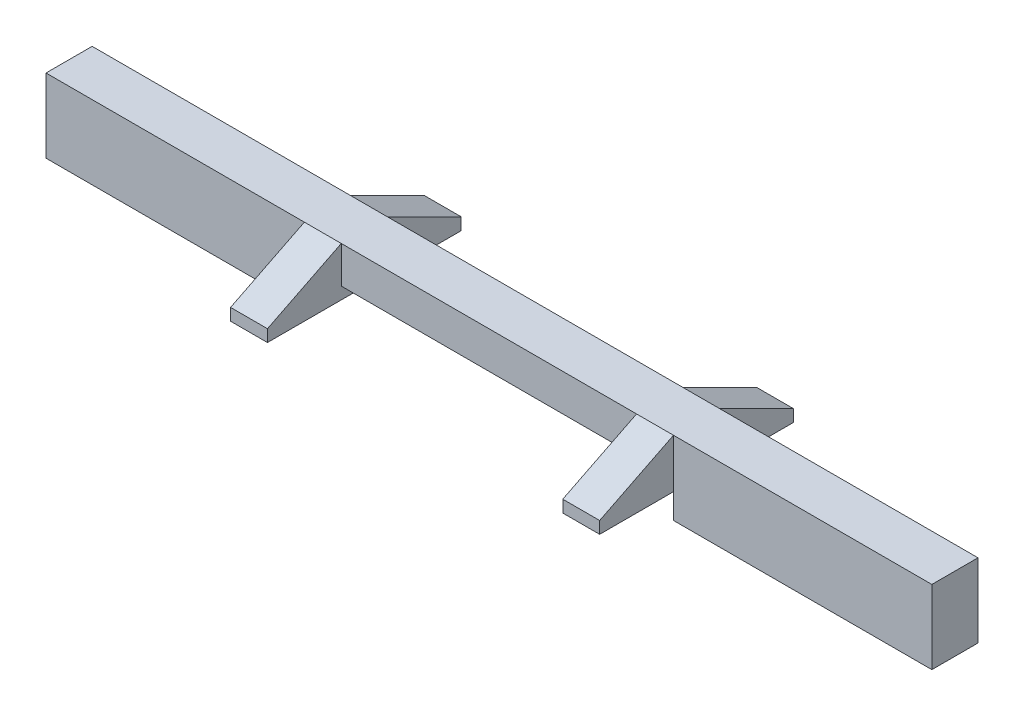
ISO-10303-21;
HEADER;
FILE_DESCRIPTION(('STEP AP214'),'2;1');
FILE_NAME('part.step','',(''),(''),'','','');
FILE_SCHEMA(('AUTOMOTIVE_DESIGN { 1 0 10303 214 1 1 1 1 }'));
ENDSEC;
DATA;
#1=APPLICATION_CONTEXT('core data for automotive mechanical design processes');
#2=APPLICATION_PROTOCOL_DEFINITION('international standard','automotive_design',2000,#1);
#3=PRODUCT_CONTEXT('',#1,'mechanical');
#4=PRODUCT('Part','Part','',(#3));
#5=PRODUCT_RELATED_PRODUCT_CATEGORY('part','',(#4));
#6=PRODUCT_DEFINITION_FORMATION('','',#4);
#7=PRODUCT_DEFINITION_CONTEXT('part definition',#1,'design');
#8=PRODUCT_DEFINITION('design','',#6,#7);
#9=PRODUCT_DEFINITION_SHAPE('','',#8);
#10=(LENGTH_UNIT() NAMED_UNIT(*) SI_UNIT(.MILLI.,.METRE.));
#11=(NAMED_UNIT(*) PLANE_ANGLE_UNIT() SI_UNIT($,.RADIAN.));
#12=(NAMED_UNIT(*) SI_UNIT($,.STERADIAN.) SOLID_ANGLE_UNIT());
#13=UNCERTAINTY_MEASURE_WITH_UNIT(LENGTH_MEASURE(1.E-05),#10,'distance_accuracy_value','');
#14=(GEOMETRIC_REPRESENTATION_CONTEXT(3) GLOBAL_UNCERTAINTY_ASSIGNED_CONTEXT((#13)) GLOBAL_UNIT_ASSIGNED_CONTEXT((#10,
#11,#12)) REPRESENTATION_CONTEXT('',''));
#15=CARTESIAN_POINT('',(0.,0.,0.));
#16=DIRECTION('',(0.,0.,1.));
#17=DIRECTION('',(1.,0.,0.));
#18=AXIS2_PLACEMENT_3D('',#15,#16,#17);
#19=CARTESIAN_POINT('',(0.,0.,1.25));
#20=DIRECTION('',(0.,0.,-1.));
#21=DIRECTION('',(-1.,0.,0.));
#22=AXIS2_PLACEMENT_3D('',#19,#20,#21);
#23=PLANE('',#22);
#24=DIRECTION('',(0.,-1.,0.));
#25=VECTOR('',#24,1.);
#26=CARTESIAN_POINT('',(1.,1.,1.25));
#27=LINE('',#26,#25);
#28=CARTESIAN_POINT('',(1.,1.,1.25));
#29=VERTEX_POINT('',#28);
#30=CARTESIAN_POINT('',(1.,0.,1.25));
#31=VERTEX_POINT('',#30);
#32=EDGE_CURVE('E280',#29,#31,#27,.T.);
#33=ORIENTED_EDGE('',*,*,#32,.T.);
#34=DIRECTION('',(1.,0.,0.));
#35=VECTOR('',#34,1.);
#36=CARTESIAN_POINT('',(1.,0.,1.25));
#37=LINE('',#36,#35);
#38=CARTESIAN_POINT('',(9.,0.,1.25));
#39=VERTEX_POINT('',#38);
#40=EDGE_CURVE('E127',#31,#39,#37,.T.);
#41=ORIENTED_EDGE('',*,*,#40,.T.);
#42=DIRECTION('',(0.,1.,0.));
#43=VECTOR('',#42,1.);
#44=CARTESIAN_POINT('',(9.,-0.325,1.25));
#45=LINE('',#44,#43);
#46=CARTESIAN_POINT('',(9.,1.,1.25));
#47=VERTEX_POINT('',#46);
#48=EDGE_CURVE('E276',#39,#47,#45,.T.);
#49=ORIENTED_EDGE('',*,*,#48,.T.);
#50=DIRECTION('',(-1.,0.,0.));
#51=VECTOR('',#50,1.);
#52=CARTESIAN_POINT('',(10.,1.,1.25));
#53=LINE('',#52,#51);
#54=EDGE_CURVE('E259',#47,#29,#53,.T.);
#55=ORIENTED_EDGE('',*,*,#54,.T.);
#56=EDGE_LOOP('',(#33,#41,#49,#55));
#57=FACE_BOUND('',#56,.T.);
#58=ADVANCED_FACE('F39',(#57),#23,.F.);
#59=CARTESIAN_POINT('',(0.,0.,0.));
#60=DIRECTION('',(0.,0.,-1.));
#61=DIRECTION('',(-1.,0.,0.));
#62=AXIS2_PLACEMENT_3D('',#59,#60,#61);
#63=PLANE('',#62);
#64=DIRECTION('',(1.,0.,0.));
#65=VECTOR('',#64,1.);
#66=CARTESIAN_POINT('',(1.,0.,0.));
#67=LINE('',#66,#65);
#68=CARTESIAN_POINT('',(1.,0.,0.));
#69=VERTEX_POINT('',#68);
#70=CARTESIAN_POINT('',(9.,0.,0.));
#71=VERTEX_POINT('',#70);
#72=EDGE_CURVE('E159',#69,#71,#67,.T.);
#73=ORIENTED_EDGE('',*,*,#72,.F.);
#74=DIRECTION('',(0.,1.,0.));
#75=VECTOR('',#74,1.);
#76=CARTESIAN_POINT('',(1.,0.999999999999999,0.));
#77=LINE('',#76,#75);
#78=CARTESIAN_POINT('',(1.,0.999999999999999,0.));
#79=VERTEX_POINT('',#78);
#80=EDGE_CURVE('E460',#69,#79,#77,.T.);
#81=ORIENTED_EDGE('',*,*,#80,.T.);
#82=DIRECTION('',(-1.,0.,0.));
#83=VECTOR('',#82,1.);
#84=CARTESIAN_POINT('',(0.,1.,0.));
#85=LINE('',#84,#83);
#86=CARTESIAN_POINT('',(9.,1.,0.));
#87=VERTEX_POINT('',#86);
#88=EDGE_CURVE('E148',#87,#79,#85,.T.);
#89=ORIENTED_EDGE('',*,*,#88,.F.);
#90=DIRECTION('',(0.,-1.,0.));
#91=VECTOR('',#90,1.);
#92=CARTESIAN_POINT('',(9.,1.,0.));
#93=LINE('',#92,#91);
#94=EDGE_CURVE('E294',#87,#71,#93,.T.);
#95=ORIENTED_EDGE('',*,*,#94,.T.);
#96=EDGE_LOOP('',(#73,#81,#89,#95));
#97=FACE_BOUND('',#96,.T.);
#98=ADVANCED_FACE('F494',(#97),#63,.T.);
#99=DIRECTION('',(0.,-1.,0.));
#100=VECTOR('',#99,1.);
#101=CARTESIAN_POINT('',(10.,-0.325,0.));
#102=LINE('',#101,#100);
#103=CARTESIAN_POINT('',(10.,1.,0.));
#104=VERTEX_POINT('',#103);
#105=CARTESIAN_POINT('',(10.,-0.325,0.));
#106=VERTEX_POINT('',#105);
#107=EDGE_CURVE('E390',#104,#106,#102,.T.);
#108=ORIENTED_EDGE('',*,*,#107,.F.);
#109=CARTESIAN_POINT('',(17.,1.,0.));
#110=VERTEX_POINT('',#109);
#111=EDGE_CURVE('E92',#110,#104,#85,.T.);
#112=ORIENTED_EDGE('',*,*,#111,.F.);
#113=DIRECTION('',(0.,1.,0.));
#114=VECTOR('',#113,1.);
#115=CARTESIAN_POINT('',(17.,1.,0.));
#116=LINE('',#115,#114);
#117=CARTESIAN_POINT('',(17.,-1.,0.));
#118=VERTEX_POINT('',#117);
#119=EDGE_CURVE('E167',#118,#110,#116,.T.);
#120=ORIENTED_EDGE('',*,*,#119,.F.);
#121=DIRECTION('',(1.,0.,0.));
#122=VECTOR('',#121,1.);
#123=CARTESIAN_POINT('',(10.,-1.,0.));
#124=LINE('',#123,#122);
#125=CARTESIAN_POINT('',(10.,-1.,0.));
#126=VERTEX_POINT('',#125);
#127=EDGE_CURVE('E84',#126,#118,#124,.T.);
#128=ORIENTED_EDGE('',*,*,#127,.F.);
#129=DIRECTION('',(0.,-1.,0.));
#130=VECTOR('',#129,1.);
#131=CARTESIAN_POINT('',(10.,-0.325,0.));
#132=LINE('',#131,#130);
#133=EDGE_CURVE('E132',#106,#126,#132,.T.);
#134=ORIENTED_EDGE('',*,*,#133,.F.);
#135=EDGE_LOOP('',(#108,#112,#120,#128,#134));
#136=FACE_BOUND('',#135,.T.);
#137=ADVANCED_FACE('F525',(#136),#63,.T.);
#138=DIRECTION('',(0.,-1.,0.));
#139=VECTOR('',#138,1.);
#140=CARTESIAN_POINT('',(0.,-0.325,1.25));
#141=LINE('',#140,#139);
#142=CARTESIAN_POINT('',(0.,1.,1.25));
#143=VERTEX_POINT('',#142);
#144=CARTESIAN_POINT('',(0.,-0.325,1.25));
#145=VERTEX_POINT('',#144);
#146=EDGE_CURVE('E254',#143,#145,#141,.T.);
#147=ORIENTED_EDGE('',*,*,#146,.F.);
#148=CARTESIAN_POINT('',(-7.,0.999999999999999,1.25));
#149=VERTEX_POINT('',#148);
#150=EDGE_CURVE('E101',#143,#149,#53,.T.);
#151=ORIENTED_EDGE('',*,*,#150,.T.);
#152=DIRECTION('',(0.,-1.,0.));
#153=VECTOR('',#152,1.);
#154=CARTESIAN_POINT('',(-7.,0.999999999999999,1.25));
#155=LINE('',#154,#153);
#156=CARTESIAN_POINT('',(-7.,-1.,1.25));
#157=VERTEX_POINT('',#156);
#158=EDGE_CURVE('E258',#149,#157,#155,.T.);
#159=ORIENTED_EDGE('',*,*,#158,.T.);
#160=DIRECTION('',(1.,0.,0.));
#161=VECTOR('',#160,1.);
#162=CARTESIAN_POINT('',(0.,-1.,1.25));
#163=LINE('',#162,#161);
#164=CARTESIAN_POINT('',(0.,-1.,1.25));
#165=VERTEX_POINT('',#164);
#166=EDGE_CURVE('E208',#157,#165,#163,.T.);
#167=ORIENTED_EDGE('',*,*,#166,.T.);
#168=DIRECTION('',(0.,1.,0.));
#169=VECTOR('',#168,1.);
#170=CARTESIAN_POINT('',(0.,-0.325,1.25));
#171=LINE('',#170,#169);
#172=EDGE_CURVE('E264',#165,#145,#171,.T.);
#173=ORIENTED_EDGE('',*,*,#172,.T.);
#174=EDGE_LOOP('',(#147,#151,#159,#167,#173));
#175=FACE_BOUND('',#174,.T.);
#176=ADVANCED_FACE('F543',(#175),#23,.F.);
#177=CARTESIAN_POINT('',(0.,0.999999999999999,0.));
#178=VERTEX_POINT('',#177);
#179=CARTESIAN_POINT('',(-7.,0.999999999999999,0.));
#180=VERTEX_POINT('',#179);
#181=EDGE_CURVE('E149',#178,#180,#85,.T.);
#182=ORIENTED_EDGE('',*,*,#181,.F.);
#183=DIRECTION('',(0.,1.,0.));
#184=VECTOR('',#183,1.);
#185=CARTESIAN_POINT('',(0.,-0.325,0.));
#186=LINE('',#185,#184);
#187=CARTESIAN_POINT('',(0.,-0.325,0.));
#188=VERTEX_POINT('',#187);
#189=EDGE_CURVE('E219',#188,#178,#186,.T.);
#190=ORIENTED_EDGE('',*,*,#189,.F.);
#191=DIRECTION('',(0.,1.,0.));
#192=VECTOR('',#191,1.);
#193=CARTESIAN_POINT('',(0.,-0.325,0.));
#194=LINE('',#193,#192);
#195=CARTESIAN_POINT('',(0.,-1.,0.));
#196=VERTEX_POINT('',#195);
#197=EDGE_CURVE('E155',#196,#188,#194,.T.);
#198=ORIENTED_EDGE('',*,*,#197,.F.);
#199=DIRECTION('',(1.,0.,0.));
#200=VECTOR('',#199,1.);
#201=CARTESIAN_POINT('',(0.,-1.,0.));
#202=LINE('',#201,#200);
#203=CARTESIAN_POINT('',(-7.,-1.,0.));
#204=VERTEX_POINT('',#203);
#205=EDGE_CURVE('E152',#204,#196,#202,.T.);
#206=ORIENTED_EDGE('',*,*,#205,.F.);
#207=DIRECTION('',(0.,-1.,0.));
#208=VECTOR('',#207,1.);
#209=CARTESIAN_POINT('',(-7.,0.999999999999999,0.));
#210=LINE('',#209,#208);
#211=EDGE_CURVE('E147',#180,#204,#210,.T.);
#212=ORIENTED_EDGE('',*,*,#211,.F.);
#213=EDGE_LOOP('',(#182,#190,#198,#206,#212));
#214=FACE_BOUND('',#213,.T.);
#215=ADVANCED_FACE('F215',(#214),#63,.T.);
#216=CARTESIAN_POINT('',(17.,1.,1.25));
#217=VERTEX_POINT('',#216);
#218=CARTESIAN_POINT('',(10.,1.,1.25));
#219=VERTEX_POINT('',#218);
#220=EDGE_CURVE('E255',#217,#219,#53,.T.);
#221=ORIENTED_EDGE('',*,*,#220,.T.);
#222=DIRECTION('',(0.,1.,0.));
#223=VECTOR('',#222,1.);
#224=CARTESIAN_POINT('',(10.,-0.325,1.25));
#225=LINE('',#224,#223);
#226=CARTESIAN_POINT('',(10.,-0.325,1.25));
#227=VERTEX_POINT('',#226);
#228=EDGE_CURVE('E122',#227,#219,#225,.T.);
#229=ORIENTED_EDGE('',*,*,#228,.F.);
#230=DIRECTION('',(0.,-1.,0.));
#231=VECTOR('',#230,1.);
#232=CARTESIAN_POINT('',(10.,-0.325,1.25));
#233=LINE('',#232,#231);
#234=CARTESIAN_POINT('',(10.,-1.,1.25));
#235=VERTEX_POINT('',#234);
#236=EDGE_CURVE('E115',#227,#235,#233,.T.);
#237=ORIENTED_EDGE('',*,*,#236,.T.);
#238=DIRECTION('',(1.,0.,0.));
#239=VECTOR('',#238,1.);
#240=CARTESIAN_POINT('',(10.,-1.,1.25));
#241=LINE('',#240,#239);
#242=CARTESIAN_POINT('',(17.,-1.,1.25));
#243=VERTEX_POINT('',#242);
#244=EDGE_CURVE('E119',#235,#243,#241,.T.);
#245=ORIENTED_EDGE('',*,*,#244,.T.);
#246=DIRECTION('',(0.,1.,0.));
#247=VECTOR('',#246,1.);
#248=CARTESIAN_POINT('',(17.,1.,1.25));
#249=LINE('',#248,#247);
#250=EDGE_CURVE('E57',#243,#217,#249,.T.);
#251=ORIENTED_EDGE('',*,*,#250,.T.);
#252=EDGE_LOOP('',(#221,#229,#237,#245,#251));
#253=FACE_BOUND('',#252,.T.);
#254=ADVANCED_FACE('F117',(#253),#23,.F.);
#255=CARTESIAN_POINT('',(0.,1.,1.25));
#256=DIRECTION('',(0.,-1.,0.));
#257=DIRECTION('',(1.,0.,0.));
#258=AXIS2_PLACEMENT_3D('',#255,#256,#257);
#259=PLANE('',#258);
#260=ORIENTED_EDGE('',*,*,#111,.T.);
#261=DIRECTION('',(1.,0.,0.));
#262=VECTOR('',#261,1.);
#263=CARTESIAN_POINT('',(9.,1.,0.));
#264=LINE('',#263,#262);
#265=EDGE_CURVE('E434',#87,#104,#264,.T.);
#266=ORIENTED_EDGE('',*,*,#265,.F.);
#267=ORIENTED_EDGE('',*,*,#88,.T.);
#268=DIRECTION('',(-1.,0.,0.));
#269=VECTOR('',#268,1.);
#270=CARTESIAN_POINT('',(1.,0.999999999999999,0.));
#271=LINE('',#270,#269);
#272=EDGE_CURVE('E447',#79,#178,#271,.T.);
#273=ORIENTED_EDGE('',*,*,#272,.T.);
#274=ORIENTED_EDGE('',*,*,#181,.T.);
#275=DIRECTION('',(0.,0.,-1.));
#276=VECTOR('',#275,1.);
#277=CARTESIAN_POINT('',(-7.,0.999999999999999,1.25));
#278=LINE('',#277,#276);
#279=EDGE_CURVE('E11',#149,#180,#278,.T.);
#280=ORIENTED_EDGE('',*,*,#279,.F.);
#281=ORIENTED_EDGE('',*,*,#150,.F.);
#282=DIRECTION('',(-1.,0.,0.));
#283=VECTOR('',#282,1.);
#284=CARTESIAN_POINT('',(1.,1.,1.25));
#285=LINE('',#284,#283);
#286=EDGE_CURVE('E461',#29,#143,#285,.T.);
#287=ORIENTED_EDGE('',*,*,#286,.F.);
#288=ORIENTED_EDGE('',*,*,#54,.F.);
#289=DIRECTION('',(1.,0.,0.));
#290=VECTOR('',#289,1.);
#291=CARTESIAN_POINT('',(9.,1.,1.25));
#292=LINE('',#291,#290);
#293=EDGE_CURVE('E414',#47,#219,#292,.T.);
#294=ORIENTED_EDGE('',*,*,#293,.T.);
#295=ORIENTED_EDGE('',*,*,#220,.F.);
#296=DIRECTION('',(0.,0.,-1.));
#297=VECTOR('',#296,1.);
#298=CARTESIAN_POINT('',(17.,1.,1.25));
#299=LINE('',#298,#297);
#300=EDGE_CURVE('E141',#217,#110,#299,.T.);
#301=ORIENTED_EDGE('',*,*,#300,.T.);
#302=EDGE_LOOP('',(#260,#266,#267,#273,#274,#280,#281,#287,#288,#294,#295,#301));
#303=FACE_BOUND('',#302,.T.);
#304=ADVANCED_FACE('F41',(#303),#259,.F.);
#305=CARTESIAN_POINT('',(-7.,0.999999999999999,1.25));
#306=DIRECTION('',(1.,0.,0.));
#307=DIRECTION('',(0.,1.,0.));
#308=AXIS2_PLACEMENT_3D('',#305,#306,#307);
#309=PLANE('',#308);
#310=ORIENTED_EDGE('',*,*,#211,.T.);
#311=DIRECTION('',(0.,0.,-1.));
#312=VECTOR('',#311,1.);
#313=CARTESIAN_POINT('',(-7.,-1.,1.25));
#314=LINE('',#313,#312);
#315=EDGE_CURVE('E49',#157,#204,#314,.T.);
#316=ORIENTED_EDGE('',*,*,#315,.F.);
#317=ORIENTED_EDGE('',*,*,#158,.F.);
#318=ORIENTED_EDGE('',*,*,#279,.T.);
#319=EDGE_LOOP('',(#310,#316,#317,#318));
#320=FACE_BOUND('',#319,.T.);
#321=ADVANCED_FACE('F553',(#320),#309,.F.);
#322=CARTESIAN_POINT('',(0.,-1.,1.25));
#323=DIRECTION('',(0.,1.,0.));
#324=DIRECTION('',(-1.,0.,0.));
#325=AXIS2_PLACEMENT_3D('',#322,#323,#324);
#326=PLANE('',#325);
#327=ORIENTED_EDGE('',*,*,#205,.T.);
#328=DIRECTION('',(0.,0.,-1.));
#329=VECTOR('',#328,1.);
#330=CARTESIAN_POINT('',(0.,-1.,1.25));
#331=LINE('',#330,#329);
#332=EDGE_CURVE('E197',#165,#196,#331,.T.);
#333=ORIENTED_EDGE('',*,*,#332,.F.);
#334=ORIENTED_EDGE('',*,*,#166,.F.);
#335=ORIENTED_EDGE('',*,*,#315,.T.);
#336=EDGE_LOOP('',(#327,#333,#334,#335));
#337=FACE_BOUND('',#336,.T.);
#338=ADVANCED_FACE('F206',(#337),#326,.F.);
#339=CARTESIAN_POINT('',(0.,-0.325,1.25));
#340=DIRECTION('',(-1.,0.,0.));
#341=DIRECTION('',(0.,-1.,0.));
#342=AXIS2_PLACEMENT_3D('',#339,#340,#341);
#343=PLANE('',#342);
#344=ORIENTED_EDGE('',*,*,#197,.T.);
#345=DIRECTION('',(0.,0.,-1.));
#346=VECTOR('',#345,1.);
#347=CARTESIAN_POINT('',(0.,-0.325,1.25));
#348=LINE('',#347,#346);
#349=EDGE_CURVE('E193',#145,#188,#348,.T.);
#350=ORIENTED_EDGE('',*,*,#349,.F.);
#351=ORIENTED_EDGE('',*,*,#172,.F.);
#352=ORIENTED_EDGE('',*,*,#332,.T.);
#353=EDGE_LOOP('',(#344,#350,#351,#352));
#354=FACE_BOUND('',#353,.T.);
#355=ADVANCED_FACE('F222',(#354),#343,.F.);
#356=CARTESIAN_POINT('',(0.,-0.325,1.25));
#357=DIRECTION('',(0.,1.,0.));
#358=DIRECTION('',(0.,0.,1.));
#359=AXIS2_PLACEMENT_3D('',#356,#357,#358);
#360=PLANE('',#359);
#361=ORIENTED_EDGE('',*,*,#349,.T.);
#362=DIRECTION('',(0.,0.,1.));
#363=VECTOR('',#362,1.);
#364=CARTESIAN_POINT('',(0.,-0.325,-2.));
#365=LINE('',#364,#363);
#366=CARTESIAN_POINT('',(0.,-0.325,-2.));
#367=VERTEX_POINT('',#366);
#368=EDGE_CURVE('E235',#367,#188,#365,.T.);
#369=ORIENTED_EDGE('',*,*,#368,.F.);
#370=DIRECTION('',(-1.,0.,0.));
#371=VECTOR('',#370,1.);
#372=CARTESIAN_POINT('',(1.,-0.325,-2.));
#373=LINE('',#372,#371);
#374=CARTESIAN_POINT('',(1.,-0.325,-2.));
#375=VERTEX_POINT('',#374);
#376=EDGE_CURVE('E343',#375,#367,#373,.T.);
#377=ORIENTED_EDGE('',*,*,#376,.F.);
#378=DIRECTION('',(0.,0.,-1.));
#379=VECTOR('',#378,1.);
#380=CARTESIAN_POINT('',(1.,-0.325,1.25));
#381=LINE('',#380,#379);
#382=CARTESIAN_POINT('',(1.,-0.325,3.25));
#383=VERTEX_POINT('',#382);
#384=EDGE_CURVE('E189',#383,#375,#381,.T.);
#385=ORIENTED_EDGE('',*,*,#384,.F.);
#386=DIRECTION('',(1.,0.,0.));
#387=VECTOR('',#386,1.);
#388=CARTESIAN_POINT('',(1.,-0.325,3.25));
#389=LINE('',#388,#387);
#390=CARTESIAN_POINT('',(0.,-0.325,3.25));
#391=VERTEX_POINT('',#390);
#392=EDGE_CURVE('E243',#391,#383,#389,.T.);
#393=ORIENTED_EDGE('',*,*,#392,.F.);
#394=DIRECTION('',(0.,0.,-1.));
#395=VECTOR('',#394,1.);
#396=CARTESIAN_POINT('',(0.,-0.325,3.25));
#397=LINE('',#396,#395);
#398=EDGE_CURVE('E239',#391,#145,#397,.T.);
#399=ORIENTED_EDGE('',*,*,#398,.T.);
#400=EDGE_LOOP('',(#361,#369,#377,#385,#393,#399));
#401=FACE_BOUND('',#400,.T.);
#402=ADVANCED_FACE('F232',(#401),#360,.F.);
#403=CARTESIAN_POINT('',(1.,0.,1.25));
#404=DIRECTION('',(-1.,0.,0.));
#405=DIRECTION('',(0.,0.,1.));
#406=AXIS2_PLACEMENT_3D('',#403,#404,#405);
#407=PLANE('',#406);
#408=ORIENTED_EDGE('',*,*,#384,.T.);
#409=DIRECTION('',(0.,-1.,0.));
#410=VECTOR('',#409,1.);
#411=CARTESIAN_POINT('',(1.,-0.325,-2.));
#412=LINE('',#411,#410);
#413=CARTESIAN_POINT('',(1.,0.,-2.));
#414=VERTEX_POINT('',#413);
#415=EDGE_CURVE('E413',#414,#375,#412,.T.);
#416=ORIENTED_EDGE('',*,*,#415,.F.);
#417=DIRECTION('',(0.,-0.447213595499958,-0.894427190999916));
#418=VECTOR('',#417,1.);
#419=CARTESIAN_POINT('',(1.,0.,-2.));
#420=LINE('',#419,#418);
#421=EDGE_CURVE('E455',#79,#414,#420,.T.);
#422=ORIENTED_EDGE('',*,*,#421,.F.);
#423=ORIENTED_EDGE('',*,*,#80,.F.);
#424=DIRECTION('',(0.,0.,-1.));
#425=VECTOR('',#424,1.);
#426=CARTESIAN_POINT('',(1.,0.,1.25));
#427=LINE('',#426,#425);
#428=EDGE_CURVE('E185',#31,#69,#427,.T.);
#429=ORIENTED_EDGE('',*,*,#428,.F.);
#430=ORIENTED_EDGE('',*,*,#32,.F.);
#431=DIRECTION('',(0.,0.447213595499958,-0.894427190999916));
#432=VECTOR('',#431,1.);
#433=CARTESIAN_POINT('',(1.,0.,3.25));
#434=LINE('',#433,#432);
#435=CARTESIAN_POINT('',(1.,0.,3.25));
#436=VERTEX_POINT('',#435);
#437=EDGE_CURVE('E355',#436,#29,#434,.T.);
#438=ORIENTED_EDGE('',*,*,#437,.F.);
#439=DIRECTION('',(0.,1.,0.));
#440=VECTOR('',#439,1.);
#441=CARTESIAN_POINT('',(1.,-0.325,3.25));
#442=LINE('',#441,#440);
#443=EDGE_CURVE('E351',#383,#436,#442,.T.);
#444=ORIENTED_EDGE('',*,*,#443,.F.);
#445=EDGE_LOOP('',(#408,#416,#422,#423,#429,#430,#438,#444));
#446=FACE_BOUND('',#445,.T.);
#447=ADVANCED_FACE('F353',(#446),#407,.F.);
#448=CARTESIAN_POINT('',(1.,0.,1.25));
#449=DIRECTION('',(0.,1.,0.));
#450=DIRECTION('',(-1.,0.,0.));
#451=AXIS2_PLACEMENT_3D('',#448,#449,#450);
#452=PLANE('',#451);
#453=ORIENTED_EDGE('',*,*,#72,.T.);
#454=DIRECTION('',(0.,0.,-1.));
#455=VECTOR('',#454,1.);
#456=CARTESIAN_POINT('',(9.,0.,1.25));
#457=LINE('',#456,#455);
#458=EDGE_CURVE('E181',#39,#71,#457,.T.);
#459=ORIENTED_EDGE('',*,*,#458,.F.);
#460=ORIENTED_EDGE('',*,*,#40,.F.);
#461=ORIENTED_EDGE('',*,*,#428,.T.);
#462=EDGE_LOOP('',(#453,#459,#460,#461));
#463=FACE_BOUND('',#462,.T.);
#464=ADVANCED_FACE('F284',(#463),#452,.F.);
#465=CARTESIAN_POINT('',(9.,0.,1.25));
#466=DIRECTION('',(1.,0.,0.));
#467=DIRECTION('',(0.,0.,-1.));
#468=AXIS2_PLACEMENT_3D('',#465,#466,#467);
#469=PLANE('',#468);
#470=DIRECTION('',(0.,1.,0.));
#471=VECTOR('',#470,1.);
#472=CARTESIAN_POINT('',(9.,-0.325,-2.));
#473=LINE('',#472,#471);
#474=CARTESIAN_POINT('',(9.,-0.325,-2.));
#475=VERTEX_POINT('',#474);
#476=CARTESIAN_POINT('',(9.,0.,-2.));
#477=VERTEX_POINT('',#476);
#478=EDGE_CURVE('E394',#475,#477,#473,.T.);
#479=ORIENTED_EDGE('',*,*,#478,.F.);
#480=DIRECTION('',(0.,0.,-1.));
#481=VECTOR('',#480,1.);
#482=CARTESIAN_POINT('',(9.,-0.325,1.25));
#483=LINE('',#482,#481);
#484=CARTESIAN_POINT('',(9.,-0.325,3.25));
#485=VERTEX_POINT('',#484);
#486=EDGE_CURVE('E177',#485,#475,#483,.T.);
#487=ORIENTED_EDGE('',*,*,#486,.F.);
#488=DIRECTION('',(0.,-1.,0.));
#489=VECTOR('',#488,1.);
#490=CARTESIAN_POINT('',(9.,-0.325,3.25));
#491=LINE('',#490,#489);
#492=CARTESIAN_POINT('',(9.,0.,3.25));
#493=VERTEX_POINT('',#492);
#494=EDGE_CURVE('E371',#493,#485,#491,.T.);
#495=ORIENTED_EDGE('',*,*,#494,.F.);
#496=DIRECTION('',(0.,-0.447213595499958,0.894427190999916));
#497=VECTOR('',#496,1.);
#498=CARTESIAN_POINT('',(9.,0.,3.25));
#499=LINE('',#498,#497);
#500=EDGE_CURVE('E429',#47,#493,#499,.T.);
#501=ORIENTED_EDGE('',*,*,#500,.F.);
#502=ORIENTED_EDGE('',*,*,#48,.F.);
#503=ORIENTED_EDGE('',*,*,#458,.T.);
#504=ORIENTED_EDGE('',*,*,#94,.F.);
#505=DIRECTION('',(0.,0.447213595499958,0.894427190999916));
#506=VECTOR('',#505,1.);
#507=CARTESIAN_POINT('',(9.,0.,-2.));
#508=LINE('',#507,#506);
#509=EDGE_CURVE('E446',#477,#87,#508,.T.);
#510=ORIENTED_EDGE('',*,*,#509,.F.);
#511=EDGE_LOOP('',(#479,#487,#495,#501,#502,#503,#504,#510));
#512=FACE_BOUND('',#511,.T.);
#513=ADVANCED_FACE('F290',(#512),#469,.F.);
#514=CARTESIAN_POINT('',(10.,-0.325,1.25));
#515=DIRECTION('',(0.,1.,0.));
#516=DIRECTION('',(-1.,0.,0.));
#517=AXIS2_PLACEMENT_3D('',#514,#515,#516);
#518=PLANE('',#517);
#519=DIRECTION('',(0.,0.,-1.));
#520=VECTOR('',#519,1.);
#521=CARTESIAN_POINT('',(10.,-0.325,1.25));
#522=LINE('',#521,#520);
#523=EDGE_CURVE('E134',#227,#106,#522,.T.);
#524=ORIENTED_EDGE('',*,*,#523,.F.);
#525=DIRECTION('',(0.,0.,-1.));
#526=VECTOR('',#525,1.);
#527=CARTESIAN_POINT('',(10.,-0.325,3.25));
#528=LINE('',#527,#526);
#529=CARTESIAN_POINT('',(10.,-0.325,3.25));
#530=VERTEX_POINT('',#529);
#531=EDGE_CURVE('E362',#530,#227,#528,.T.);
#532=ORIENTED_EDGE('',*,*,#531,.F.);
#533=DIRECTION('',(1.,0.,0.));
#534=VECTOR('',#533,1.);
#535=CARTESIAN_POINT('',(9.,-0.325,3.25));
#536=LINE('',#535,#534);
#537=EDGE_CURVE('E380',#485,#530,#536,.T.);
#538=ORIENTED_EDGE('',*,*,#537,.F.);
#539=ORIENTED_EDGE('',*,*,#486,.T.);
#540=DIRECTION('',(-1.,0.,0.));
#541=VECTOR('',#540,1.);
#542=CARTESIAN_POINT('',(9.,-0.325,-2.));
#543=LINE('',#542,#541);
#544=CARTESIAN_POINT('',(10.,-0.325,-2.));
#545=VERTEX_POINT('',#544);
#546=EDGE_CURVE('E389',#545,#475,#543,.T.);
#547=ORIENTED_EDGE('',*,*,#546,.F.);
#548=DIRECTION('',(0.,0.,1.));
#549=VECTOR('',#548,1.);
#550=CARTESIAN_POINT('',(10.,-0.325,-2.));
#551=LINE('',#550,#549);
#552=EDGE_CURVE('E372',#545,#106,#551,.T.);
#553=ORIENTED_EDGE('',*,*,#552,.T.);
#554=EDGE_LOOP('',(#524,#532,#538,#539,#547,#553));
#555=FACE_BOUND('',#554,.T.);
#556=ADVANCED_FACE('F513',(#555),#518,.F.);
#557=CARTESIAN_POINT('',(10.,-0.325,1.25));
#558=DIRECTION('',(1.,0.,0.));
#559=DIRECTION('',(0.,0.,-1.));
#560=AXIS2_PLACEMENT_3D('',#557,#558,#559);
#561=PLANE('',#560);
#562=ORIENTED_EDGE('',*,*,#133,.T.);
#563=DIRECTION('',(0.,0.,-1.));
#564=VECTOR('',#563,1.);
#565=CARTESIAN_POINT('',(10.,-1.,1.25));
#566=LINE('',#565,#564);
#567=EDGE_CURVE('E129',#235,#126,#566,.T.);
#568=ORIENTED_EDGE('',*,*,#567,.F.);
#569=ORIENTED_EDGE('',*,*,#236,.F.);
#570=ORIENTED_EDGE('',*,*,#523,.T.);
#571=EDGE_LOOP('',(#562,#568,#569,#570));
#572=FACE_BOUND('',#571,.T.);
#573=ADVANCED_FACE('F130',(#572),#561,.F.);
#574=CARTESIAN_POINT('',(10.,-1.,1.25));
#575=DIRECTION('',(0.,1.,0.));
#576=DIRECTION('',(0.,0.,1.));
#577=AXIS2_PLACEMENT_3D('',#574,#575,#576);
#578=PLANE('',#577);
#579=ORIENTED_EDGE('',*,*,#127,.T.);
#580=DIRECTION('',(0.,0.,-1.));
#581=VECTOR('',#580,1.);
#582=CARTESIAN_POINT('',(17.,-1.,1.25));
#583=LINE('',#582,#581);
#584=EDGE_CURVE('E135',#243,#118,#583,.T.);
#585=ORIENTED_EDGE('',*,*,#584,.F.);
#586=ORIENTED_EDGE('',*,*,#244,.F.);
#587=ORIENTED_EDGE('',*,*,#567,.T.);
#588=EDGE_LOOP('',(#579,#585,#586,#587));
#589=FACE_BOUND('',#588,.T.);
#590=ADVANCED_FACE('F137',(#589),#578,.F.);
#591=CARTESIAN_POINT('',(17.,1.,1.25));
#592=DIRECTION('',(-1.,0.,0.));
#593=DIRECTION('',(0.,0.,1.));
#594=AXIS2_PLACEMENT_3D('',#591,#592,#593);
#595=PLANE('',#594);
#596=ORIENTED_EDGE('',*,*,#119,.T.);
#597=ORIENTED_EDGE('',*,*,#300,.F.);
#598=ORIENTED_EDGE('',*,*,#250,.F.);
#599=ORIENTED_EDGE('',*,*,#584,.T.);
#600=EDGE_LOOP('',(#596,#597,#598,#599));
#601=FACE_BOUND('',#600,.T.);
#602=ADVANCED_FACE('F530',(#601),#595,.F.);
#603=CARTESIAN_POINT('',(0.,-0.325,3.25));
#604=DIRECTION('',(1.,0.,0.));
#605=DIRECTION('',(0.,0.,-1.));
#606=AXIS2_PLACEMENT_3D('',#603,#604,#605);
#607=PLANE('',#606);
#608=ORIENTED_EDGE('',*,*,#146,.T.);
#609=ORIENTED_EDGE('',*,*,#398,.F.);
#610=DIRECTION('',(0.,-1.,0.));
#611=VECTOR('',#610,1.);
#612=CARTESIAN_POINT('',(0.,-0.325,3.25));
#613=LINE('',#612,#611);
#614=CARTESIAN_POINT('',(0.,0.,3.25));
#615=VERTEX_POINT('',#614);
#616=EDGE_CURVE('E250',#615,#391,#613,.T.);
#617=ORIENTED_EDGE('',*,*,#616,.F.);
#618=DIRECTION('',(0.,0.447213595499958,-0.894427190999916));
#619=VECTOR('',#618,1.);
#620=CARTESIAN_POINT('',(0.,0.,3.25));
#621=LINE('',#620,#619);
#622=EDGE_CURVE('E470',#615,#143,#621,.T.);
#623=ORIENTED_EDGE('',*,*,#622,.T.);
#624=EDGE_LOOP('',(#608,#609,#617,#623));
#625=FACE_BOUND('',#624,.T.);
#626=ADVANCED_FACE('F532',(#625),#607,.F.);
#627=CARTESIAN_POINT('',(0.,0.,3.25));
#628=DIRECTION('',(0.,0.,1.));
#629=DIRECTION('',(1.,0.,0.));
#630=AXIS2_PLACEMENT_3D('',#627,#628,#629);
#631=PLANE('',#630);
#632=ORIENTED_EDGE('',*,*,#443,.T.);
#633=DIRECTION('',(-1.,0.,0.));
#634=VECTOR('',#633,1.);
#635=CARTESIAN_POINT('',(1.,0.,3.25));
#636=LINE('',#635,#634);
#637=EDGE_CURVE('E357',#436,#615,#636,.T.);
#638=ORIENTED_EDGE('',*,*,#637,.T.);
#639=ORIENTED_EDGE('',*,*,#616,.T.);
#640=ORIENTED_EDGE('',*,*,#392,.T.);
#641=EDGE_LOOP('',(#632,#638,#639,#640));
#642=FACE_BOUND('',#641,.T.);
#643=ADVANCED_FACE('F349',(#642),#631,.T.);
#644=CARTESIAN_POINT('',(10.,-0.325,3.25));
#645=DIRECTION('',(-1.,0.,0.));
#646=DIRECTION('',(0.,0.,1.));
#647=AXIS2_PLACEMENT_3D('',#644,#645,#646);
#648=PLANE('',#647);
#649=ORIENTED_EDGE('',*,*,#228,.T.);
#650=DIRECTION('',(0.,-0.447213595499958,0.894427190999916));
#651=VECTOR('',#650,1.);
#652=CARTESIAN_POINT('',(10.,0.,3.25));
#653=LINE('',#652,#651);
#654=CARTESIAN_POINT('',(10.,0.,3.25));
#655=VERTEX_POINT('',#654);
#656=EDGE_CURVE('E430',#219,#655,#653,.T.);
#657=ORIENTED_EDGE('',*,*,#656,.T.);
#658=DIRECTION('',(0.,1.,0.));
#659=VECTOR('',#658,1.);
#660=CARTESIAN_POINT('',(10.,-0.325,3.25));
#661=LINE('',#660,#659);
#662=EDGE_CURVE('E376',#530,#655,#661,.T.);
#663=ORIENTED_EDGE('',*,*,#662,.F.);
#664=ORIENTED_EDGE('',*,*,#531,.T.);
#665=EDGE_LOOP('',(#649,#657,#663,#664));
#666=FACE_BOUND('',#665,.T.);
#667=ADVANCED_FACE('F524',(#666),#648,.F.);
#668=CARTESIAN_POINT('',(0.,0.,3.25));
#669=DIRECTION('',(0.,0.,-1.));
#670=DIRECTION('',(-1.,0.,0.));
#671=AXIS2_PLACEMENT_3D('',#668,#669,#670);
#672=PLANE('',#671);
#673=ORIENTED_EDGE('',*,*,#494,.T.);
#674=ORIENTED_EDGE('',*,*,#537,.T.);
#675=ORIENTED_EDGE('',*,*,#662,.T.);
#676=DIRECTION('',(-1.,0.,0.));
#677=VECTOR('',#676,1.);
#678=CARTESIAN_POINT('',(9.,0.,3.25));
#679=LINE('',#678,#677);
#680=EDGE_CURVE('E368',#655,#493,#679,.T.);
#681=ORIENTED_EDGE('',*,*,#680,.T.);
#682=EDGE_LOOP('',(#673,#674,#675,#681));
#683=FACE_BOUND('',#682,.T.);
#684=ADVANCED_FACE('F518',(#683),#672,.F.);
#685=CARTESIAN_POINT('',(10.,-0.325,-2.));
#686=DIRECTION('',(-1.,0.,0.));
#687=DIRECTION('',(0.,0.,1.));
#688=AXIS2_PLACEMENT_3D('',#685,#686,#687);
#689=PLANE('',#688);
#690=ORIENTED_EDGE('',*,*,#107,.T.);
#691=ORIENTED_EDGE('',*,*,#552,.F.);
#692=DIRECTION('',(0.,-1.,0.));
#693=VECTOR('',#692,1.);
#694=CARTESIAN_POINT('',(10.,-0.325,-2.));
#695=LINE('',#694,#693);
#696=CARTESIAN_POINT('',(10.,0.,-2.));
#697=VERTEX_POINT('',#696);
#698=EDGE_CURVE('E398',#697,#545,#695,.T.);
#699=ORIENTED_EDGE('',*,*,#698,.F.);
#700=DIRECTION('',(0.,0.447213595499958,0.894427190999916));
#701=VECTOR('',#700,1.);
#702=CARTESIAN_POINT('',(10.,0.,-2.));
#703=LINE('',#702,#701);
#704=EDGE_CURVE('E442',#697,#104,#703,.T.);
#705=ORIENTED_EDGE('',*,*,#704,.T.);
#706=EDGE_LOOP('',(#690,#691,#699,#705));
#707=FACE_BOUND('',#706,.T.);
#708=ADVANCED_FACE('F527',(#707),#689,.F.);
#709=CARTESIAN_POINT('',(0.,0.,-2.));
#710=DIRECTION('',(0.,0.,-1.));
#711=DIRECTION('',(-1.,0.,0.));
#712=AXIS2_PLACEMENT_3D('',#709,#710,#711);
#713=PLANE('',#712);
#714=ORIENTED_EDGE('',*,*,#478,.T.);
#715=DIRECTION('',(1.,0.,0.));
#716=VECTOR('',#715,1.);
#717=CARTESIAN_POINT('',(9.,0.,-2.));
#718=LINE('',#717,#716);
#719=EDGE_CURVE('E401',#477,#697,#718,.T.);
#720=ORIENTED_EDGE('',*,*,#719,.T.);
#721=ORIENTED_EDGE('',*,*,#698,.T.);
#722=ORIENTED_EDGE('',*,*,#546,.T.);
#723=EDGE_LOOP('',(#714,#720,#721,#722));
#724=FACE_BOUND('',#723,.T.);
#725=ADVANCED_FACE('F509',(#724),#713,.T.);
#726=CARTESIAN_POINT('',(0.,-0.325,-2.));
#727=DIRECTION('',(1.,0.,0.));
#728=DIRECTION('',(0.,0.,-1.));
#729=AXIS2_PLACEMENT_3D('',#726,#727,#728);
#730=PLANE('',#729);
#731=ORIENTED_EDGE('',*,*,#189,.T.);
#732=DIRECTION('',(0.,-0.447213595499958,-0.894427190999916));
#733=VECTOR('',#732,1.);
#734=CARTESIAN_POINT('',(0.,0.,-2.));
#735=LINE('',#734,#733);
#736=CARTESIAN_POINT('',(0.,0.,-2.));
#737=VERTEX_POINT('',#736);
#738=EDGE_CURVE('E456',#178,#737,#735,.T.);
#739=ORIENTED_EDGE('',*,*,#738,.T.);
#740=DIRECTION('',(0.,1.,0.));
#741=VECTOR('',#740,1.);
#742=CARTESIAN_POINT('',(0.,-0.325,-2.));
#743=LINE('',#742,#741);
#744=EDGE_CURVE('E418',#367,#737,#743,.T.);
#745=ORIENTED_EDGE('',*,*,#744,.F.);
#746=ORIENTED_EDGE('',*,*,#368,.T.);
#747=EDGE_LOOP('',(#731,#739,#745,#746));
#748=FACE_BOUND('',#747,.T.);
#749=ADVANCED_FACE('F628',(#748),#730,.F.);
#750=CARTESIAN_POINT('',(0.,0.,-2.));
#751=DIRECTION('',(0.,0.,1.));
#752=DIRECTION('',(1.,0.,0.));
#753=AXIS2_PLACEMENT_3D('',#750,#751,#752);
#754=PLANE('',#753);
#755=ORIENTED_EDGE('',*,*,#415,.T.);
#756=ORIENTED_EDGE('',*,*,#376,.T.);
#757=ORIENTED_EDGE('',*,*,#744,.T.);
#758=DIRECTION('',(1.,0.,0.));
#759=VECTOR('',#758,1.);
#760=CARTESIAN_POINT('',(1.,0.,-2.));
#761=LINE('',#760,#759);
#762=EDGE_CURVE('E410',#737,#414,#761,.T.);
#763=ORIENTED_EDGE('',*,*,#762,.T.);
#764=EDGE_LOOP('',(#755,#756,#757,#763));
#765=FACE_BOUND('',#764,.T.);
#766=ADVANCED_FACE('F632',(#765),#754,.F.);
#767=CARTESIAN_POINT('',(9.,0.,3.25));
#768=DIRECTION('',(0.,0.894427190999916,0.447213595499958));
#769=DIRECTION('',(0.,-0.447213595499958,0.894427190999916));
#770=AXIS2_PLACEMENT_3D('',#767,#768,#769);
#771=PLANE('',#770);
#772=ORIENTED_EDGE('',*,*,#656,.F.);
#773=ORIENTED_EDGE('',*,*,#293,.F.);
#774=ORIENTED_EDGE('',*,*,#500,.T.);
#775=ORIENTED_EDGE('',*,*,#680,.F.);
#776=EDGE_LOOP('',(#772,#773,#774,#775));
#777=FACE_BOUND('',#776,.T.);
#778=ADVANCED_FACE('F522',(#777),#771,.T.);
#779=CARTESIAN_POINT('',(9.,0.,-2.));
#780=DIRECTION('',(0.,0.894427190999916,-0.447213595499958));
#781=DIRECTION('',(0.,0.447213595499958,0.894427190999916));
#782=AXIS2_PLACEMENT_3D('',#779,#780,#781);
#783=PLANE('',#782);
#784=ORIENTED_EDGE('',*,*,#704,.F.);
#785=ORIENTED_EDGE('',*,*,#719,.F.);
#786=ORIENTED_EDGE('',*,*,#509,.T.);
#787=ORIENTED_EDGE('',*,*,#265,.T.);
#788=EDGE_LOOP('',(#784,#785,#786,#787));
#789=FACE_BOUND('',#788,.T.);
#790=ADVANCED_FACE('F506',(#789),#783,.T.);
#791=CARTESIAN_POINT('',(1.,0.,-2.));
#792=DIRECTION('',(0.,0.894427190999916,-0.447213595499958));
#793=DIRECTION('',(0.,0.447213595499958,0.894427190999916));
#794=AXIS2_PLACEMENT_3D('',#791,#792,#793);
#795=PLANE('',#794);
#796=ORIENTED_EDGE('',*,*,#738,.F.);
#797=ORIENTED_EDGE('',*,*,#272,.F.);
#798=ORIENTED_EDGE('',*,*,#421,.T.);
#799=ORIENTED_EDGE('',*,*,#762,.F.);
#800=EDGE_LOOP('',(#796,#797,#798,#799));
#801=FACE_BOUND('',#800,.T.);
#802=ADVANCED_FACE('F650',(#801),#795,.T.);
#803=CARTESIAN_POINT('',(1.,0.,3.25));
#804=DIRECTION('',(0.,0.894427190999916,0.447213595499958));
#805=DIRECTION('',(0.,-0.447213595499958,0.894427190999916));
#806=AXIS2_PLACEMENT_3D('',#803,#804,#805);
#807=PLANE('',#806);
#808=ORIENTED_EDGE('',*,*,#622,.F.);
#809=ORIENTED_EDGE('',*,*,#637,.F.);
#810=ORIENTED_EDGE('',*,*,#437,.T.);
#811=ORIENTED_EDGE('',*,*,#286,.T.);
#812=EDGE_LOOP('',(#808,#809,#810,#811));
#813=FACE_BOUND('',#812,.T.);
#814=ADVANCED_FACE('F481',(#813),#807,.T.);
#815=CLOSED_SHELL('',(#58,#98,#137,#176,#215,#254,#304,#321,#338,#355,#402,#447,#464,#513,#556,
#573,#590,#602,#626,#643,#667,#684,#708,#725,#749,#766,#778,#790,#802,#814));
#816=MANIFOLD_SOLID_BREP('B2',#815);
#817=ADVANCED_BREP_SHAPE_REPRESENTATION('',(#18,#816),#14);
#818=SHAPE_DEFINITION_REPRESENTATION(#9,#817);
ENDSEC;
END-ISO-10303-21;
